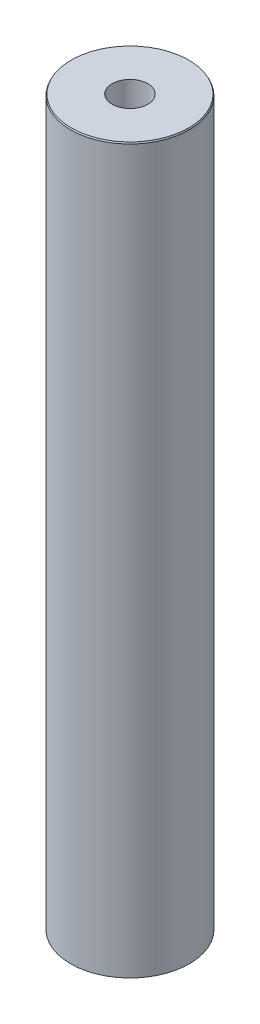
ISO-10303-21;
HEADER;
FILE_DESCRIPTION(('STEP AP214'),'2;1');
FILE_NAME('part.step','',(''),(''),'','','');
FILE_SCHEMA(('AUTOMOTIVE_DESIGN { 1 0 10303 214 1 1 1 1 }'));
ENDSEC;
DATA;
#1=APPLICATION_CONTEXT('core data for automotive mechanical design processes');
#2=APPLICATION_PROTOCOL_DEFINITION('international standard','automotive_design',2000,#1);
#3=PRODUCT_CONTEXT('',#1,'mechanical');
#4=PRODUCT('Part','Part','',(#3));
#5=PRODUCT_RELATED_PRODUCT_CATEGORY('part','',(#4));
#6=PRODUCT_DEFINITION_FORMATION('','',#4);
#7=PRODUCT_DEFINITION_CONTEXT('part definition',#1,'design');
#8=PRODUCT_DEFINITION('design','',#6,#7);
#9=PRODUCT_DEFINITION_SHAPE('','',#8);
#10=(LENGTH_UNIT() NAMED_UNIT(*) SI_UNIT(.MILLI.,.METRE.));
#11=(NAMED_UNIT(*) PLANE_ANGLE_UNIT() SI_UNIT($,.RADIAN.));
#12=(NAMED_UNIT(*) SI_UNIT($,.STERADIAN.) SOLID_ANGLE_UNIT());
#13=UNCERTAINTY_MEASURE_WITH_UNIT(LENGTH_MEASURE(1.E-05),#10,'distance_accuracy_value','');
#14=(GEOMETRIC_REPRESENTATION_CONTEXT(3) GLOBAL_UNCERTAINTY_ASSIGNED_CONTEXT((#13)) GLOBAL_UNIT_ASSIGNED_CONTEXT((#10,
#11,#12)) REPRESENTATION_CONTEXT('',''));
#15=CARTESIAN_POINT('',(0.,0.,0.));
#16=DIRECTION('',(0.,0.,1.));
#17=DIRECTION('',(1.,0.,0.));
#18=AXIS2_PLACEMENT_3D('',#15,#16,#17);
#19=CARTESIAN_POINT('',(0.,578.925987916666,0.));
#20=DIRECTION('',(0.,-1.,0.));
#21=DIRECTION('',(0.,0.,-1.));
#22=AXIS2_PLACEMENT_3D('',#19,#20,#21);
#23=CYLINDRICAL_SURFACE('',#22,47.5);
#24=CARTESIAN_POINT('',(0.,577.842381020455,0.));
#25=DIRECTION('',(0.,1.,0.));
#26=DIRECTION('',(0.,0.,1.));
#27=AXIS2_PLACEMENT_3D('',#24,#25,#26);
#28=CIRCLE('',#27,47.5);
#29=CARTESIAN_POINT('',(0.,577.842381020455,47.5));
#30=VERTEX_POINT('',#29);
#31=EDGE_CURVE('E50',#30,#30,#28,.F.);
#32=ORIENTED_EDGE('',*,*,#31,.T.);
#33=EDGE_LOOP('',(#32));
#34=FACE_BOUND('',#33,.T.);
#35=CARTESIAN_POINT('',(0.,0.522423361486779,0.));
#36=DIRECTION('',(0.,1.,0.));
#37=DIRECTION('',(0.,0.,1.));
#38=AXIS2_PLACEMENT_3D('',#35,#36,#37);
#39=CIRCLE('',#38,47.5);
#40=CARTESIAN_POINT('',(0.,0.522423361486779,47.5));
#41=VERTEX_POINT('',#40);
#42=EDGE_CURVE('E51',#41,#41,#39,.T.);
#43=ORIENTED_EDGE('',*,*,#42,.T.);
#44=EDGE_LOOP('',(#43));
#45=FACE_BOUND('',#44,.T.);
#46=ADVANCED_FACE('F39',(#34,#45),#23,.T.);
#47=CARTESIAN_POINT('',(0.,578.925987916666,0.));
#48=DIRECTION('',(0.,1.,0.));
#49=DIRECTION('',(0.,0.,1.));
#50=AXIS2_PLACEMENT_3D('',#47,#48,#49);
#51=PLANE('',#50);
#52=CARTESIAN_POINT('',(0.,578.925987916666,0.));
#53=DIRECTION('',(0.,1.,0.));
#54=DIRECTION('',(0.,0.,1.));
#55=AXIS2_PLACEMENT_3D('',#52,#53,#54);
#56=CIRCLE('',#55,46.9775766385131);
#57=CARTESIAN_POINT('',(0.,578.925987916666,46.9775766385131));
#58=VERTEX_POINT('',#57);
#59=EDGE_CURVE('E54',#58,#58,#56,.T.);
#60=ORIENTED_EDGE('',*,*,#59,.T.);
#61=EDGE_LOOP('',(#60));
#62=FACE_BOUND('',#61,.T.);
#63=CARTESIAN_POINT('',(0.,578.925987916666,0.));
#64=DIRECTION('',(0.,1.,0.));
#65=DIRECTION('',(0.,0.,1.));
#66=AXIS2_PLACEMENT_3D('',#63,#64,#65);
#67=CIRCLE('',#66,14.2789421799873);
#68=CARTESIAN_POINT('',(0.,578.925987916666,14.2789421799873));
#69=VERTEX_POINT('',#68);
#70=EDGE_CURVE('E58',#69,#69,#67,.T.);
#71=ORIENTED_EDGE('',*,*,#70,.F.);
#72=EDGE_LOOP('',(#71));
#73=FACE_BOUND('',#72,.T.);
#74=ADVANCED_FACE('F69',(#62,#73),#51,.T.);
#75=CARTESIAN_POINT('',(0.,0.,0.));
#76=DIRECTION('',(0.,1.,0.));
#77=DIRECTION('',(0.,0.,1.));
#78=AXIS2_PLACEMENT_3D('',#75,#76,#77);
#79=PLANE('',#78);
#80=CARTESIAN_POINT('',(0.,0.,0.));
#81=DIRECTION('',(0.,1.,0.));
#82=DIRECTION('',(0.,0.,1.));
#83=AXIS2_PLACEMENT_3D('',#80,#81,#82);
#84=CIRCLE('',#83,46.416393103789);
#85=CARTESIAN_POINT('',(0.,0.,46.416393103789));
#86=VERTEX_POINT('',#85);
#87=EDGE_CURVE('E10',#86,#86,#84,.F.);
#88=ORIENTED_EDGE('',*,*,#87,.T.);
#89=EDGE_LOOP('',(#88));
#90=FACE_BOUND('',#89,.T.);
#91=CARTESIAN_POINT('',(0.,0.,0.));
#92=DIRECTION('',(0.,1.,0.));
#93=DIRECTION('',(0.,0.,1.));
#94=AXIS2_PLACEMENT_3D('',#91,#92,#93);
#95=CIRCLE('',#94,14.2789421799873);
#96=CARTESIAN_POINT('',(0.,0.,14.2789421799873));
#97=VERTEX_POINT('',#96);
#98=EDGE_CURVE('E63',#97,#97,#95,.T.);
#99=ORIENTED_EDGE('',*,*,#98,.T.);
#100=EDGE_LOOP('',(#99));
#101=FACE_BOUND('',#100,.T.);
#102=ADVANCED_FACE('F75',(#90,#101),#79,.F.);
#103=CARTESIAN_POINT('',(0.,578.925987916666,0.));
#104=DIRECTION('',(0.,-1.,0.));
#105=DIRECTION('',(0.,0.,-1.));
#106=AXIS2_PLACEMENT_3D('',#103,#104,#105);
#107=CYLINDRICAL_SURFACE('',#106,14.2789421799873);
#108=ORIENTED_EDGE('',*,*,#70,.T.);
#109=EDGE_LOOP('',(#108));
#110=FACE_BOUND('',#109,.T.);
#111=ORIENTED_EDGE('',*,*,#98,.F.);
#112=EDGE_LOOP('',(#111));
#113=FACE_BOUND('',#112,.T.);
#114=ADVANCED_FACE('F70',(#110,#113),#107,.F.);
#115=CARTESIAN_POINT('',(0.,578.925987916666,0.));
#116=DIRECTION('',(0.,-1.,0.));
#117=DIRECTION('',(0.,0.,-1.));
#118=AXIS2_PLACEMENT_3D('',#115,#116,#117);
#119=CONICAL_SURFACE('',#118,46.9775766385131,0.449237676291687);
#120=ORIENTED_EDGE('',*,*,#31,.F.);
#121=EDGE_LOOP('',(#120));
#122=FACE_BOUND('',#121,.T.);
#123=ORIENTED_EDGE('',*,*,#59,.F.);
#124=EDGE_LOOP('',(#123));
#125=FACE_BOUND('',#124,.T.);
#126=ADVANCED_FACE('F81',(#122,#125),#119,.T.);
#127=CARTESIAN_POINT('',(0.,0.522423361486779,0.));
#128=DIRECTION('',(0.,1.,0.));
#129=DIRECTION('',(0.,0.,1.));
#130=AXIS2_PLACEMENT_3D('',#127,#128,#129);
#131=CONICAL_SURFACE('',#130,47.5,1.12155865050325);
#132=ORIENTED_EDGE('',*,*,#87,.F.);
#133=EDGE_LOOP('',(#132));
#134=FACE_BOUND('',#133,.T.);
#135=ORIENTED_EDGE('',*,*,#42,.F.);
#136=EDGE_LOOP('',(#135));
#137=FACE_BOUND('',#136,.T.);
#138=ADVANCED_FACE('F45',(#134,#137),#131,.T.);
#139=CLOSED_SHELL('',(#46,#74,#102,#114,#126,#138));
#140=MANIFOLD_SOLID_BREP('B2',#139);
#141=ADVANCED_BREP_SHAPE_REPRESENTATION('',(#18,#140),#14);
#142=SHAPE_DEFINITION_REPRESENTATION(#9,#141);
ENDSEC;
END-ISO-10303-21;
